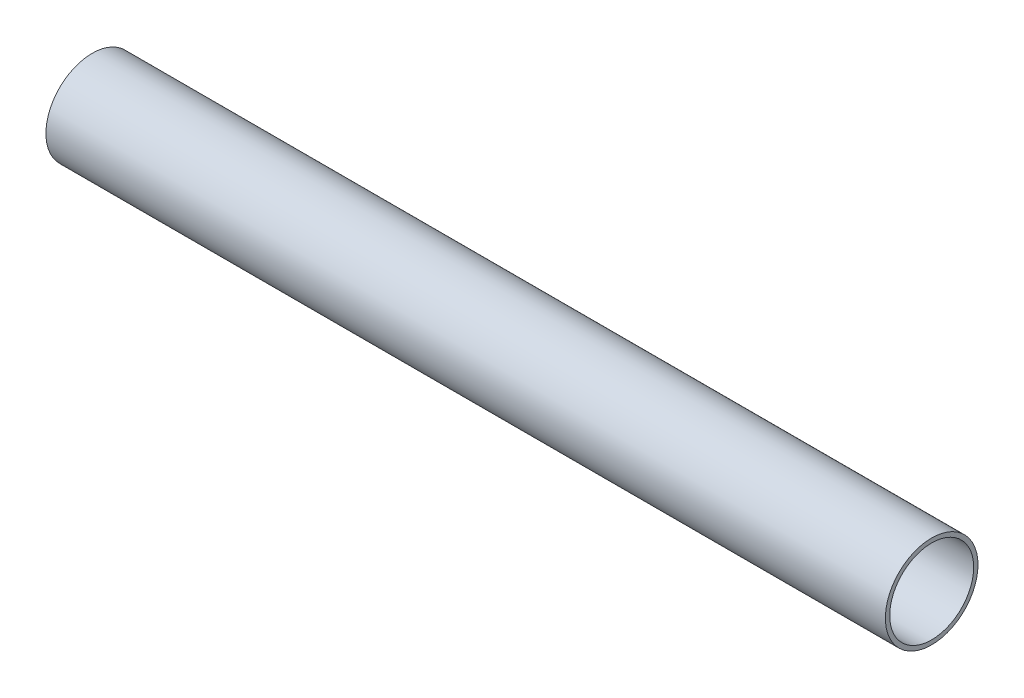
ISO-10303-21;
HEADER;
FILE_DESCRIPTION(('STEP AP214'),'2;1');
FILE_NAME('part.step','',(''),(''),'','','');
FILE_SCHEMA(('AUTOMOTIVE_DESIGN { 1 0 10303 214 1 1 1 1 }'));
ENDSEC;
DATA;
#1=APPLICATION_CONTEXT('core data for automotive mechanical design processes');
#2=APPLICATION_PROTOCOL_DEFINITION('international standard','automotive_design',2000,#1);
#3=PRODUCT_CONTEXT('',#1,'mechanical');
#4=PRODUCT('Part','Part','',(#3));
#5=PRODUCT_RELATED_PRODUCT_CATEGORY('part','',(#4));
#6=PRODUCT_DEFINITION_FORMATION('','',#4);
#7=PRODUCT_DEFINITION_CONTEXT('part definition',#1,'design');
#8=PRODUCT_DEFINITION('design','',#6,#7);
#9=PRODUCT_DEFINITION_SHAPE('','',#8);
#10=(LENGTH_UNIT() NAMED_UNIT(*) SI_UNIT(.MILLI.,.METRE.));
#11=(NAMED_UNIT(*) PLANE_ANGLE_UNIT() SI_UNIT($,.RADIAN.));
#12=(NAMED_UNIT(*) SI_UNIT($,.STERADIAN.) SOLID_ANGLE_UNIT());
#13=UNCERTAINTY_MEASURE_WITH_UNIT(LENGTH_MEASURE(1.E-05),#10,'distance_accuracy_value','');
#14=(GEOMETRIC_REPRESENTATION_CONTEXT(3) GLOBAL_UNCERTAINTY_ASSIGNED_CONTEXT((#13)) GLOBAL_UNIT_ASSIGNED_CONTEXT((#10,
#11,#12)) REPRESENTATION_CONTEXT('',''));
#15=CARTESIAN_POINT('',(0.,0.,0.));
#16=DIRECTION('',(0.,0.,1.));
#17=DIRECTION('',(1.,0.,0.));
#18=AXIS2_PLACEMENT_3D('',#15,#16,#17);
#19=CARTESIAN_POINT('',(0.,0.,0.));
#20=DIRECTION('',(1.,0.,0.));
#21=DIRECTION('',(0.,0.,-1.));
#22=AXIS2_PLACEMENT_3D('',#19,#20,#21);
#23=CYLINDRICAL_SURFACE('',#22,7.25);
#24=CARTESIAN_POINT('',(145.,0.,0.));
#25=DIRECTION('',(1.,0.,0.));
#26=DIRECTION('',(0.,0.,-1.));
#27=AXIS2_PLACEMENT_3D('',#24,#25,#26);
#28=CIRCLE('',#27,7.25);
#29=CARTESIAN_POINT('',(145.,0.,-7.25));
#30=VERTEX_POINT('',#29);
#31=EDGE_CURVE('E28',#30,#30,#28,.F.);
#32=ORIENTED_EDGE('',*,*,#31,.F.);
#33=EDGE_LOOP('',(#32));
#34=FACE_BOUND('',#33,.T.);
#35=CARTESIAN_POINT('',(0.,0.,0.));
#36=DIRECTION('',(1.,0.,0.));
#37=DIRECTION('',(0.,0.,-1.));
#38=AXIS2_PLACEMENT_3D('',#35,#36,#37);
#39=CIRCLE('',#38,7.25);
#40=CARTESIAN_POINT('',(0.,0.,-7.25));
#41=VERTEX_POINT('',#40);
#42=EDGE_CURVE('E19',#41,#41,#39,.F.);
#43=ORIENTED_EDGE('',*,*,#42,.T.);
#44=EDGE_LOOP('',(#43));
#45=FACE_BOUND('',#44,.T.);
#46=ADVANCED_FACE('F16',(#34,#45),#23,.F.);
#47=CARTESIAN_POINT('',(0.,0.,0.));
#48=DIRECTION('',(1.,0.,0.));
#49=DIRECTION('',(0.,0.,-1.));
#50=AXIS2_PLACEMENT_3D('',#47,#48,#49);
#51=PLANE('',#50);
#52=ORIENTED_EDGE('',*,*,#42,.F.);
#53=EDGE_LOOP('',(#52));
#54=FACE_BOUND('',#53,.T.);
#55=CARTESIAN_POINT('',(0.,0.,0.));
#56=DIRECTION('',(1.,0.,0.));
#57=DIRECTION('',(0.,0.,-1.));
#58=AXIS2_PLACEMENT_3D('',#55,#56,#57);
#59=CIRCLE('',#58,8.);
#60=CARTESIAN_POINT('',(0.,0.,-8.));
#61=VERTEX_POINT('',#60);
#62=EDGE_CURVE('E23',#61,#61,#59,.T.);
#63=ORIENTED_EDGE('',*,*,#62,.F.);
#64=EDGE_LOOP('',(#63));
#65=FACE_BOUND('',#64,.T.);
#66=ADVANCED_FACE('F37',(#54,#65),#51,.F.);
#67=CARTESIAN_POINT('',(145.,0.,0.));
#68=DIRECTION('',(1.,0.,0.));
#69=DIRECTION('',(0.,0.,-1.));
#70=AXIS2_PLACEMENT_3D('',#67,#68,#69);
#71=PLANE('',#70);
#72=ORIENTED_EDGE('',*,*,#31,.T.);
#73=EDGE_LOOP('',(#72));
#74=FACE_BOUND('',#73,.T.);
#75=CARTESIAN_POINT('',(145.,0.,0.));
#76=DIRECTION('',(1.,0.,0.));
#77=DIRECTION('',(0.,0.,-1.));
#78=AXIS2_PLACEMENT_3D('',#75,#76,#77);
#79=CIRCLE('',#78,8.);
#80=CARTESIAN_POINT('',(145.,0.,-8.));
#81=VERTEX_POINT('',#80);
#82=EDGE_CURVE('E10',#81,#81,#79,.F.);
#83=ORIENTED_EDGE('',*,*,#82,.F.);
#84=EDGE_LOOP('',(#83));
#85=FACE_BOUND('',#84,.T.);
#86=ADVANCED_FACE('F40',(#74,#85),#71,.T.);
#87=CARTESIAN_POINT('',(0.,0.,0.));
#88=DIRECTION('',(1.,0.,0.));
#89=DIRECTION('',(0.,0.,-1.));
#90=AXIS2_PLACEMENT_3D('',#87,#88,#89);
#91=CYLINDRICAL_SURFACE('',#90,8.);
#92=ORIENTED_EDGE('',*,*,#82,.T.);
#93=EDGE_LOOP('',(#92));
#94=FACE_BOUND('',#93,.T.);
#95=ORIENTED_EDGE('',*,*,#62,.T.);
#96=EDGE_LOOP('',(#95));
#97=FACE_BOUND('',#96,.T.);
#98=ADVANCED_FACE('F43',(#94,#97),#91,.T.);
#99=CLOSED_SHELL('',(#46,#66,#86,#98));
#100=MANIFOLD_SOLID_BREP('B1',#99);
#101=ADVANCED_BREP_SHAPE_REPRESENTATION('',(#18,#100),#14);
#102=SHAPE_DEFINITION_REPRESENTATION(#9,#101);
ENDSEC;
END-ISO-10303-21;
